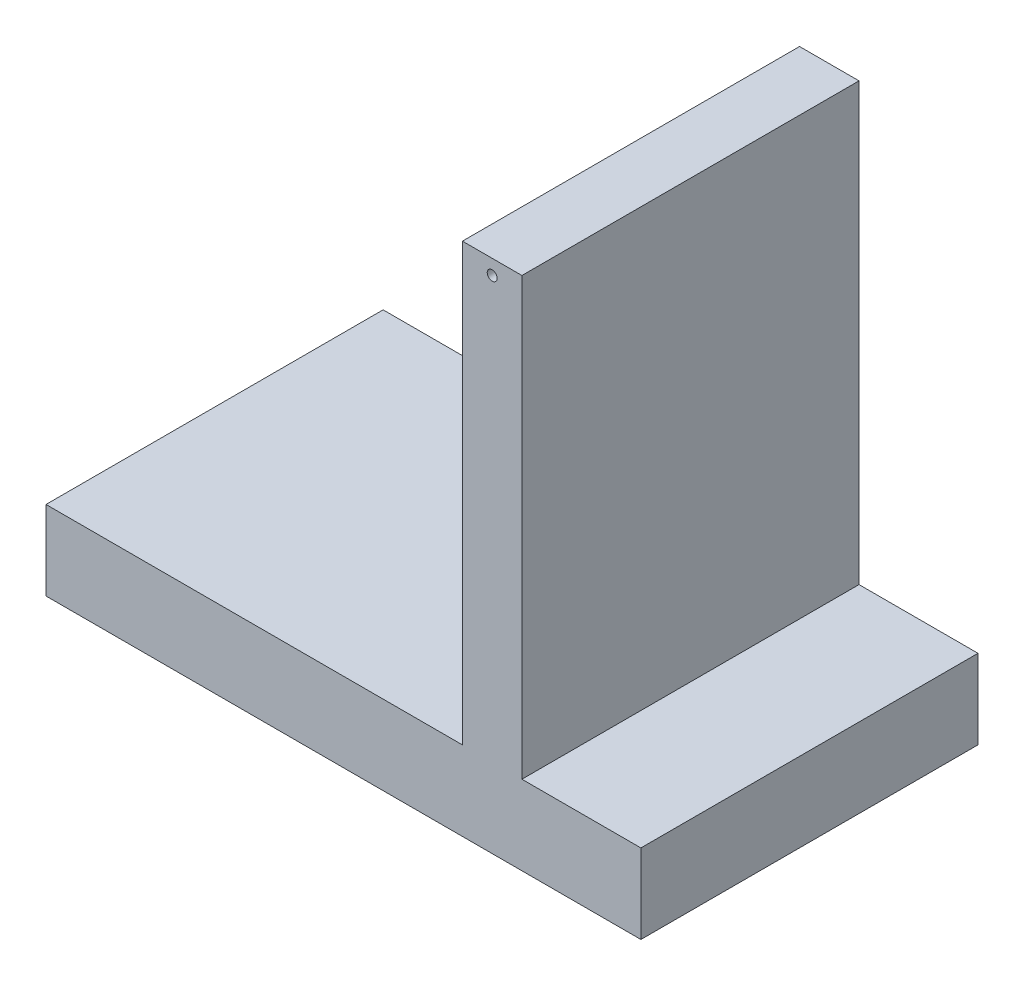
ISO-10303-21;
HEADER;
FILE_DESCRIPTION(('STEP AP214'),'2;1');
FILE_NAME('part.step','',(''),(''),'','','');
FILE_SCHEMA(('AUTOMOTIVE_DESIGN { 1 0 10303 214 1 1 1 1 }'));
ENDSEC;
DATA;
#1=APPLICATION_CONTEXT('core data for automotive mechanical design processes');
#2=APPLICATION_PROTOCOL_DEFINITION('international standard','automotive_design',2000,#1);
#3=PRODUCT_CONTEXT('',#1,'mechanical');
#4=PRODUCT('Part','Part','',(#3));
#5=PRODUCT_RELATED_PRODUCT_CATEGORY('part','',(#4));
#6=PRODUCT_DEFINITION_FORMATION('','',#4);
#7=PRODUCT_DEFINITION_CONTEXT('part definition',#1,'design');
#8=PRODUCT_DEFINITION('design','',#6,#7);
#9=PRODUCT_DEFINITION_SHAPE('','',#8);
#10=(LENGTH_UNIT() NAMED_UNIT(*) SI_UNIT(.MILLI.,.METRE.));
#11=(NAMED_UNIT(*) PLANE_ANGLE_UNIT() SI_UNIT($,.RADIAN.));
#12=(NAMED_UNIT(*) SI_UNIT($,.STERADIAN.) SOLID_ANGLE_UNIT());
#13=UNCERTAINTY_MEASURE_WITH_UNIT(LENGTH_MEASURE(1.E-05),#10,'distance_accuracy_value','');
#14=(GEOMETRIC_REPRESENTATION_CONTEXT(3) GLOBAL_UNCERTAINTY_ASSIGNED_CONTEXT((#13)) GLOBAL_UNIT_ASSIGNED_CONTEXT((#10,
#11,#12)) REPRESENTATION_CONTEXT('',''));
#15=CARTESIAN_POINT('',(0.,0.,0.));
#16=DIRECTION('',(0.,0.,1.));
#17=DIRECTION('',(1.,0.,0.));
#18=AXIS2_PLACEMENT_3D('',#15,#16,#17);
#19=CARTESIAN_POINT('',(228.6,0.,215.9));
#20=DIRECTION('',(1.,0.,0.));
#21=DIRECTION('',(0.,1.,0.));
#22=AXIS2_PLACEMENT_3D('',#19,#20,#21);
#23=PLANE('',#22);
#24=DIRECTION('',(0.,-1.,0.));
#25=VECTOR('',#24,1.);
#26=CARTESIAN_POINT('',(228.6,0.,-215.9));
#27=LINE('',#26,#25);
#28=CARTESIAN_POINT('',(228.6,609.6,-215.9));
#29=VERTEX_POINT('',#28);
#30=CARTESIAN_POINT('',(228.6,50.8,-215.9));
#31=VERTEX_POINT('',#30);
#32=EDGE_CURVE('E132',#29,#31,#27,.T.);
#33=ORIENTED_EDGE('',*,*,#32,.F.);
#34=DIRECTION('',(0.,0.,-1.));
#35=VECTOR('',#34,1.);
#36=CARTESIAN_POINT('',(228.6,609.6,215.9));
#37=LINE('',#36,#35);
#38=CARTESIAN_POINT('',(228.6,609.6,215.9));
#39=VERTEX_POINT('',#38);
#40=EDGE_CURVE('E11',#39,#29,#37,.T.);
#41=ORIENTED_EDGE('',*,*,#40,.F.);
#42=DIRECTION('',(0.,-1.,0.));
#43=VECTOR('',#42,1.);
#44=CARTESIAN_POINT('',(228.6,0.,215.9));
#45=LINE('',#44,#43);
#46=CARTESIAN_POINT('',(228.6,50.8,215.9));
#47=VERTEX_POINT('',#46);
#48=EDGE_CURVE('E174',#39,#47,#45,.T.);
#49=ORIENTED_EDGE('',*,*,#48,.T.);
#50=DIRECTION('',(0.,0.,-1.));
#51=VECTOR('',#50,1.);
#52=CARTESIAN_POINT('',(228.6,50.8,215.9));
#53=LINE('',#52,#51);
#54=EDGE_CURVE('E53',#47,#31,#53,.T.);
#55=ORIENTED_EDGE('',*,*,#54,.T.);
#56=EDGE_LOOP('',(#33,#41,#49,#55));
#57=FACE_BOUND('',#56,.T.);
#58=ADVANCED_FACE('F37',(#57),#23,.T.);
#59=CARTESIAN_POINT('',(0.,609.6,215.9));
#60=DIRECTION('',(0.,1.,0.));
#61=DIRECTION('',(0.,0.,1.));
#62=AXIS2_PLACEMENT_3D('',#59,#60,#61);
#63=PLANE('',#62);
#64=DIRECTION('',(1.,0.,0.));
#65=VECTOR('',#64,1.);
#66=CARTESIAN_POINT('',(0.,609.6,-215.9));
#67=LINE('',#66,#65);
#68=CARTESIAN_POINT('',(152.4,609.6,-215.9));
#69=VERTEX_POINT('',#68);
#70=EDGE_CURVE('E134',#69,#29,#67,.T.);
#71=ORIENTED_EDGE('',*,*,#70,.F.);
#72=DIRECTION('',(0.,0.,-1.));
#73=VECTOR('',#72,1.);
#74=CARTESIAN_POINT('',(152.4,609.6,215.9));
#75=LINE('',#74,#73);
#76=CARTESIAN_POINT('',(152.4,609.6,215.9));
#77=VERTEX_POINT('',#76);
#78=EDGE_CURVE('E45',#77,#69,#75,.T.);
#79=ORIENTED_EDGE('',*,*,#78,.F.);
#80=DIRECTION('',(1.,0.,0.));
#81=VECTOR('',#80,1.);
#82=CARTESIAN_POINT('',(0.,609.6,215.9));
#83=LINE('',#82,#81);
#84=EDGE_CURVE('E171',#77,#39,#83,.T.);
#85=ORIENTED_EDGE('',*,*,#84,.T.);
#86=ORIENTED_EDGE('',*,*,#40,.T.);
#87=EDGE_LOOP('',(#71,#79,#85,#86));
#88=FACE_BOUND('',#87,.T.);
#89=ADVANCED_FACE('F170',(#88),#63,.T.);
#90=CARTESIAN_POINT('',(152.4,0.,215.9));
#91=DIRECTION('',(1.,0.,0.));
#92=DIRECTION('',(0.,1.,0.));
#93=AXIS2_PLACEMENT_3D('',#90,#91,#92);
#94=PLANE('',#93);
#95=DIRECTION('',(0.,-1.,0.));
#96=VECTOR('',#95,1.);
#97=CARTESIAN_POINT('',(152.4,0.,-215.9));
#98=LINE('',#97,#96);
#99=CARTESIAN_POINT('',(152.4,50.8,-215.9));
#100=VERTEX_POINT('',#99);
#101=EDGE_CURVE('E138',#69,#100,#98,.T.);
#102=ORIENTED_EDGE('',*,*,#101,.T.);
#103=DIRECTION('',(0.,0.,-1.));
#104=VECTOR('',#103,1.);
#105=CARTESIAN_POINT('',(152.4,50.8,215.9));
#106=LINE('',#105,#104);
#107=CARTESIAN_POINT('',(152.4,50.8,215.9));
#108=VERTEX_POINT('',#107);
#109=EDGE_CURVE('E155',#108,#100,#106,.T.);
#110=ORIENTED_EDGE('',*,*,#109,.F.);
#111=DIRECTION('',(0.,-1.,0.));
#112=VECTOR('',#111,1.);
#113=CARTESIAN_POINT('',(152.4,0.,215.9));
#114=LINE('',#113,#112);
#115=EDGE_CURVE('E161',#77,#108,#114,.T.);
#116=ORIENTED_EDGE('',*,*,#115,.F.);
#117=ORIENTED_EDGE('',*,*,#78,.T.);
#118=EDGE_LOOP('',(#102,#110,#116,#117));
#119=FACE_BOUND('',#118,.T.);
#120=ADVANCED_FACE('F159',(#119),#94,.F.);
#121=CARTESIAN_POINT('',(0.,50.8,215.9));
#122=DIRECTION('',(0.,1.,0.));
#123=DIRECTION('',(0.,0.,1.));
#124=AXIS2_PLACEMENT_3D('',#121,#122,#123);
#125=PLANE('',#124);
#126=DIRECTION('',(1.,0.,0.));
#127=VECTOR('',#126,1.);
#128=CARTESIAN_POINT('',(0.,50.8,-215.9));
#129=LINE('',#128,#127);
#130=CARTESIAN_POINT('',(-381.,50.8,-215.9));
#131=VERTEX_POINT('',#130);
#132=EDGE_CURVE('E141',#131,#100,#129,.T.);
#133=ORIENTED_EDGE('',*,*,#132,.F.);
#134=DIRECTION('',(0.,0.,-1.));
#135=VECTOR('',#134,1.);
#136=CARTESIAN_POINT('',(-381.,50.8,215.9));
#137=LINE('',#136,#135);
#138=CARTESIAN_POINT('',(-381.,50.8,215.9));
#139=VERTEX_POINT('',#138);
#140=EDGE_CURVE('E153',#139,#131,#137,.T.);
#141=ORIENTED_EDGE('',*,*,#140,.F.);
#142=DIRECTION('',(1.,0.,0.));
#143=VECTOR('',#142,1.);
#144=CARTESIAN_POINT('',(0.,50.8,215.9));
#145=LINE('',#144,#143);
#146=EDGE_CURVE('E129',#139,#108,#145,.T.);
#147=ORIENTED_EDGE('',*,*,#146,.T.);
#148=ORIENTED_EDGE('',*,*,#109,.T.);
#149=EDGE_LOOP('',(#133,#141,#147,#148));
#150=FACE_BOUND('',#149,.T.);
#151=ADVANCED_FACE('F183',(#150),#125,.T.);
#152=CARTESIAN_POINT('',(-381.,0.,215.9));
#153=DIRECTION('',(1.,0.,0.));
#154=DIRECTION('',(0.,0.,-1.));
#155=AXIS2_PLACEMENT_3D('',#152,#153,#154);
#156=PLANE('',#155);
#157=DIRECTION('',(0.,-1.,0.));
#158=VECTOR('',#157,1.);
#159=CARTESIAN_POINT('',(-381.,0.,-215.9));
#160=LINE('',#159,#158);
#161=CARTESIAN_POINT('',(-381.,-50.8,-215.9));
#162=VERTEX_POINT('',#161);
#163=EDGE_CURVE('E144',#131,#162,#160,.T.);
#164=ORIENTED_EDGE('',*,*,#163,.T.);
#165=DIRECTION('',(0.,0.,-1.));
#166=VECTOR('',#165,1.);
#167=CARTESIAN_POINT('',(-381.,-50.8,215.9));
#168=LINE('',#167,#166);
#169=CARTESIAN_POINT('',(-381.,-50.8,215.9));
#170=VERTEX_POINT('',#169);
#171=EDGE_CURVE('E123',#170,#162,#168,.T.);
#172=ORIENTED_EDGE('',*,*,#171,.F.);
#173=DIRECTION('',(0.,-1.,0.));
#174=VECTOR('',#173,1.);
#175=CARTESIAN_POINT('',(-381.,0.,215.9));
#176=LINE('',#175,#174);
#177=EDGE_CURVE('E111',#139,#170,#176,.T.);
#178=ORIENTED_EDGE('',*,*,#177,.F.);
#179=ORIENTED_EDGE('',*,*,#140,.T.);
#180=EDGE_LOOP('',(#164,#172,#178,#179));
#181=FACE_BOUND('',#180,.T.);
#182=ADVANCED_FACE('F185',(#181),#156,.F.);
#183=CARTESIAN_POINT('',(0.,-50.8,215.9));
#184=DIRECTION('',(0.,1.,0.));
#185=DIRECTION('',(0.,0.,1.));
#186=AXIS2_PLACEMENT_3D('',#183,#184,#185);
#187=PLANE('',#186);
#188=DIRECTION('',(1.,0.,0.));
#189=VECTOR('',#188,1.);
#190=CARTESIAN_POINT('',(0.,-50.8,-215.9));
#191=LINE('',#190,#189);
#192=CARTESIAN_POINT('',(381.,-50.8,-215.9));
#193=VERTEX_POINT('',#192);
#194=EDGE_CURVE('E120',#162,#193,#191,.T.);
#195=ORIENTED_EDGE('',*,*,#194,.T.);
#196=DIRECTION('',(0.,0.,-1.));
#197=VECTOR('',#196,1.);
#198=CARTESIAN_POINT('',(381.,-50.8,215.9));
#199=LINE('',#198,#197);
#200=CARTESIAN_POINT('',(381.,-50.8,215.9));
#201=VERTEX_POINT('',#200);
#202=EDGE_CURVE('E117',#201,#193,#199,.T.);
#203=ORIENTED_EDGE('',*,*,#202,.F.);
#204=DIRECTION('',(1.,0.,0.));
#205=VECTOR('',#204,1.);
#206=CARTESIAN_POINT('',(0.,-50.8,215.9));
#207=LINE('',#206,#205);
#208=EDGE_CURVE('E103',#170,#201,#207,.T.);
#209=ORIENTED_EDGE('',*,*,#208,.F.);
#210=ORIENTED_EDGE('',*,*,#171,.T.);
#211=EDGE_LOOP('',(#195,#203,#209,#210));
#212=FACE_BOUND('',#211,.T.);
#213=ADVANCED_FACE('F118',(#212),#187,.F.);
#214=CARTESIAN_POINT('',(381.,0.,215.9));
#215=DIRECTION('',(1.,0.,0.));
#216=DIRECTION('',(0.,0.,-1.));
#217=AXIS2_PLACEMENT_3D('',#214,#215,#216);
#218=PLANE('',#217);
#219=DIRECTION('',(0.,-1.,0.));
#220=VECTOR('',#219,1.);
#221=CARTESIAN_POINT('',(381.,0.,-215.9));
#222=LINE('',#221,#220);
#223=CARTESIAN_POINT('',(381.,50.8,-215.9));
#224=VERTEX_POINT('',#223);
#225=EDGE_CURVE('E148',#224,#193,#222,.T.);
#226=ORIENTED_EDGE('',*,*,#225,.F.);
#227=DIRECTION('',(0.,0.,-1.));
#228=VECTOR('',#227,1.);
#229=CARTESIAN_POINT('',(381.,50.8,215.9));
#230=LINE('',#229,#228);
#231=CARTESIAN_POINT('',(381.,50.8,215.9));
#232=VERTEX_POINT('',#231);
#233=EDGE_CURVE('E78',#232,#224,#230,.T.);
#234=ORIENTED_EDGE('',*,*,#233,.F.);
#235=DIRECTION('',(0.,-1.,0.));
#236=VECTOR('',#235,1.);
#237=CARTESIAN_POINT('',(381.,0.,215.9));
#238=LINE('',#237,#236);
#239=EDGE_CURVE('E108',#232,#201,#238,.T.);
#240=ORIENTED_EDGE('',*,*,#239,.T.);
#241=ORIENTED_EDGE('',*,*,#202,.T.);
#242=EDGE_LOOP('',(#226,#234,#240,#241));
#243=FACE_BOUND('',#242,.T.);
#244=ADVANCED_FACE('F125',(#243),#218,.T.);
#245=EDGE_CURVE('E145',#31,#224,#129,.T.);
#246=ORIENTED_EDGE('',*,*,#245,.F.);
#247=ORIENTED_EDGE('',*,*,#54,.F.);
#248=EDGE_CURVE('E126',#47,#232,#145,.T.);
#249=ORIENTED_EDGE('',*,*,#248,.T.);
#250=ORIENTED_EDGE('',*,*,#233,.T.);
#251=EDGE_LOOP('',(#246,#247,#249,#250));
#252=FACE_BOUND('',#251,.T.);
#253=ADVANCED_FACE('F173',(#252),#125,.T.);
#254=CARTESIAN_POINT('',(0.,0.,215.9));
#255=DIRECTION('',(0.,0.,1.));
#256=DIRECTION('',(1.,0.,0.));
#257=AXIS2_PLACEMENT_3D('',#254,#255,#256);
#258=PLANE('',#257);
#259=CARTESIAN_POINT('',(190.5,590.55,215.9));
#260=DIRECTION('',(0.,0.,1.));
#261=DIRECTION('',(1.,0.,0.));
#262=AXIS2_PLACEMENT_3D('',#259,#260,#261);
#263=CIRCLE('',#262,6.34999999999999);
#264=CARTESIAN_POINT('',(196.85,590.55,215.9));
#265=VERTEX_POINT('',#264);
#266=EDGE_CURVE('E178',#265,#265,#263,.T.);
#267=ORIENTED_EDGE('',*,*,#266,.F.);
#268=EDGE_LOOP('',(#267));
#269=FACE_BOUND('',#268,.T.);
#270=ORIENTED_EDGE('',*,*,#48,.F.);
#271=ORIENTED_EDGE('',*,*,#84,.F.);
#272=ORIENTED_EDGE('',*,*,#115,.T.);
#273=ORIENTED_EDGE('',*,*,#146,.F.);
#274=ORIENTED_EDGE('',*,*,#177,.T.);
#275=ORIENTED_EDGE('',*,*,#208,.T.);
#276=ORIENTED_EDGE('',*,*,#239,.F.);
#277=ORIENTED_EDGE('',*,*,#248,.F.);
#278=EDGE_LOOP('',(#270,#271,#272,#273,#274,#275,#276,#277));
#279=FACE_BOUND('',#278,.T.);
#280=ADVANCED_FACE('F105',(#269,#279),#258,.T.);
#281=CARTESIAN_POINT('',(0.,0.,-215.9));
#282=DIRECTION('',(0.,0.,1.));
#283=DIRECTION('',(1.,0.,0.));
#284=AXIS2_PLACEMENT_3D('',#281,#282,#283);
#285=PLANE('',#284);
#286=CARTESIAN_POINT('',(190.5,590.55,-215.9));
#287=DIRECTION('',(0.,0.,1.));
#288=DIRECTION('',(1.,0.,0.));
#289=AXIS2_PLACEMENT_3D('',#286,#287,#288);
#290=CIRCLE('',#289,6.34999999999999);
#291=CARTESIAN_POINT('',(196.85,590.55,-215.9));
#292=VERTEX_POINT('',#291);
#293=EDGE_CURVE('E135',#292,#292,#290,.T.);
#294=ORIENTED_EDGE('',*,*,#293,.T.);
#295=EDGE_LOOP('',(#294));
#296=FACE_BOUND('',#295,.T.);
#297=ORIENTED_EDGE('',*,*,#32,.T.);
#298=ORIENTED_EDGE('',*,*,#245,.T.);
#299=ORIENTED_EDGE('',*,*,#225,.T.);
#300=ORIENTED_EDGE('',*,*,#194,.F.);
#301=ORIENTED_EDGE('',*,*,#163,.F.);
#302=ORIENTED_EDGE('',*,*,#132,.T.);
#303=ORIENTED_EDGE('',*,*,#101,.F.);
#304=ORIENTED_EDGE('',*,*,#70,.T.);
#305=EDGE_LOOP('',(#297,#298,#299,#300,#301,#302,#303,#304));
#306=FACE_BOUND('',#305,.T.);
#307=ADVANCED_FACE('F167',(#296,#306),#285,.F.);
#308=CARTESIAN_POINT('',(190.5,590.55,-215.9));
#309=DIRECTION('',(0.,0.,1.));
#310=DIRECTION('',(1.,0.,0.));
#311=AXIS2_PLACEMENT_3D('',#308,#309,#310);
#312=CYLINDRICAL_SURFACE('',#311,6.34999999999999);
#313=ORIENTED_EDGE('',*,*,#293,.F.);
#314=EDGE_LOOP('',(#313));
#315=FACE_BOUND('',#314,.T.);
#316=ORIENTED_EDGE('',*,*,#266,.T.);
#317=EDGE_LOOP('',(#316));
#318=FACE_BOUND('',#317,.T.);
#319=ADVANCED_FACE('F256',(#315,#318),#312,.F.);
#320=CLOSED_SHELL('',(#58,#89,#120,#151,#182,#213,#244,#253,#280,#307,#319));
#321=MANIFOLD_SOLID_BREP('B2',#320);
#322=ADVANCED_BREP_SHAPE_REPRESENTATION('',(#18,#321),#14);
#323=SHAPE_DEFINITION_REPRESENTATION(#9,#322);
ENDSEC;
END-ISO-10303-21;
